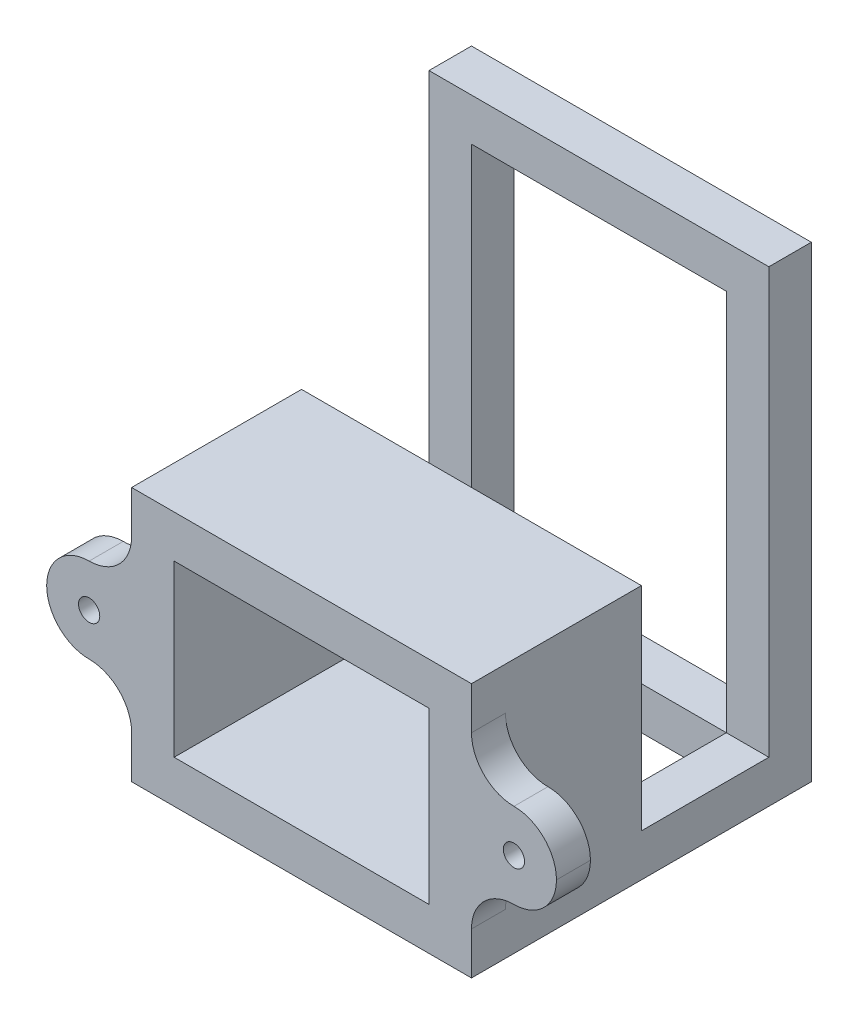
ISO-10303-21;
HEADER;
FILE_DESCRIPTION(('STEP AP214'),'2;1');
FILE_NAME('part.step','',(''),(''),'','','');
FILE_SCHEMA(('AUTOMOTIVE_DESIGN { 1 0 10303 214 1 1 1 1 }'));
ENDSEC;
DATA;
#1=APPLICATION_CONTEXT('core data for automotive mechanical design processes');
#2=APPLICATION_PROTOCOL_DEFINITION('international standard','automotive_design',2000,#1);
#3=PRODUCT_CONTEXT('',#1,'mechanical');
#4=PRODUCT('Part','Part','',(#3));
#5=PRODUCT_RELATED_PRODUCT_CATEGORY('part','',(#4));
#6=PRODUCT_DEFINITION_FORMATION('','',#4);
#7=PRODUCT_DEFINITION_CONTEXT('part definition',#1,'design');
#8=PRODUCT_DEFINITION('design','',#6,#7);
#9=PRODUCT_DEFINITION_SHAPE('','',#8);
#10=(LENGTH_UNIT() NAMED_UNIT(*) SI_UNIT(.MILLI.,.METRE.));
#11=(NAMED_UNIT(*) PLANE_ANGLE_UNIT() SI_UNIT($,.RADIAN.));
#12=(NAMED_UNIT(*) SI_UNIT($,.STERADIAN.) SOLID_ANGLE_UNIT());
#13=UNCERTAINTY_MEASURE_WITH_UNIT(LENGTH_MEASURE(1.E-05),#10,'distance_accuracy_value','');
#14=(GEOMETRIC_REPRESENTATION_CONTEXT(3) GLOBAL_UNCERTAINTY_ASSIGNED_CONTEXT((#13)) GLOBAL_UNIT_ASSIGNED_CONTEXT((#10,
#11,#12)) REPRESENTATION_CONTEXT('',''));
#15=CARTESIAN_POINT('',(0.,0.,0.));
#16=DIRECTION('',(0.,0.,1.));
#17=DIRECTION('',(1.,0.,0.));
#18=AXIS2_PLACEMENT_3D('',#15,#16,#17);
#19=CARTESIAN_POINT('',(-15.,-10.,20.));
#20=DIRECTION('',(0.,1.,0.));
#21=DIRECTION('',(0.,0.,1.));
#22=AXIS2_PLACEMENT_3D('',#19,#20,#21);
#23=PLANE('',#22);
#24=DIRECTION('',(0.,0.,1.));
#25=VECTOR('',#24,1.);
#26=CARTESIAN_POINT('',(20.,-10.,0.));
#27=LINE('',#26,#25);
#28=CARTESIAN_POINT('',(20.,-9.99999999999997,-15.));
#29=VERTEX_POINT('',#28);
#30=CARTESIAN_POINT('',(20.,-10.,0.));
#31=VERTEX_POINT('',#30);
#32=EDGE_CURVE('E331',#29,#31,#27,.T.);
#33=ORIENTED_EDGE('',*,*,#32,.F.);
#34=DIRECTION('',(-1.,0.,0.));
#35=VECTOR('',#34,1.);
#36=CARTESIAN_POINT('',(0.,-10.,-15.));
#37=LINE('',#36,#35);
#38=CARTESIAN_POINT('',(15.,-10.,-15.));
#39=VERTEX_POINT('',#38);
#40=EDGE_CURVE('E609',#29,#39,#37,.T.);
#41=ORIENTED_EDGE('',*,*,#40,.T.);
#42=DIRECTION('',(0.,0.,1.));
#43=VECTOR('',#42,1.);
#44=CARTESIAN_POINT('',(15.,-10.,-4.15209927586882));
#45=LINE('',#44,#43);
#46=CARTESIAN_POINT('',(15.,-9.99999999999999,-4.15209927586882));
#47=VERTEX_POINT('',#46);
#48=EDGE_CURVE('E332',#39,#47,#45,.T.);
#49=ORIENTED_EDGE('',*,*,#48,.T.);
#50=DIRECTION('',(-1.,0.,0.));
#51=VECTOR('',#50,1.);
#52=CARTESIAN_POINT('',(-15.,-10.,-4.15209927586882));
#53=LINE('',#52,#51);
#54=CARTESIAN_POINT('',(-15.,-10.,-4.15209927586882));
#55=VERTEX_POINT('',#54);
#56=EDGE_CURVE('E336',#47,#55,#53,.T.);
#57=ORIENTED_EDGE('',*,*,#56,.T.);
#58=DIRECTION('',(0.,0.,-1.));
#59=VECTOR('',#58,1.);
#60=CARTESIAN_POINT('',(-15.,-10.,-4.15209927586882));
#61=LINE('',#60,#59);
#62=CARTESIAN_POINT('',(-15.,-10.,-15.));
#63=VERTEX_POINT('',#62);
#64=EDGE_CURVE('E340',#55,#63,#61,.T.);
#65=ORIENTED_EDGE('',*,*,#64,.T.);
#66=DIRECTION('',(-1.,0.,0.));
#67=VECTOR('',#66,1.);
#68=CARTESIAN_POINT('',(0.,-10.,-15.));
#69=LINE('',#68,#67);
#70=CARTESIAN_POINT('',(-20.,-10.,-15.));
#71=VERTEX_POINT('',#70);
#72=EDGE_CURVE('E279',#63,#71,#69,.T.);
#73=ORIENTED_EDGE('',*,*,#72,.T.);
#74=DIRECTION('',(0.,0.,-1.));
#75=VECTOR('',#74,1.);
#76=CARTESIAN_POINT('',(-20.,-10.,0.));
#77=LINE('',#76,#75);
#78=CARTESIAN_POINT('',(-20.,-10.,0.));
#79=VERTEX_POINT('',#78);
#80=EDGE_CURVE('E74',#79,#71,#77,.T.);
#81=ORIENTED_EDGE('',*,*,#80,.F.);
#82=DIRECTION('',(-1.,0.,0.));
#83=VECTOR('',#82,1.);
#84=CARTESIAN_POINT('',(-20.,-10.,0.));
#85=LINE('',#84,#83);
#86=CARTESIAN_POINT('',(-15.,-10.,0.));
#87=VERTEX_POINT('',#86);
#88=EDGE_CURVE('E11',#87,#79,#85,.T.);
#89=ORIENTED_EDGE('',*,*,#88,.F.);
#90=DIRECTION('',(0.,0.,-1.));
#91=VECTOR('',#90,1.);
#92=CARTESIAN_POINT('',(-15.,-10.,20.));
#93=LINE('',#92,#91);
#94=CARTESIAN_POINT('',(-15.,-10.,20.));
#95=VERTEX_POINT('',#94);
#96=EDGE_CURVE('E415',#95,#87,#93,.T.);
#97=ORIENTED_EDGE('',*,*,#96,.F.);
#98=DIRECTION('',(1.,0.,0.));
#99=VECTOR('',#98,1.);
#100=CARTESIAN_POINT('',(-15.,-10.,20.));
#101=LINE('',#100,#99);
#102=CARTESIAN_POINT('',(15.,-10.,20.));
#103=VERTEX_POINT('',#102);
#104=EDGE_CURVE('E398',#95,#103,#101,.T.);
#105=ORIENTED_EDGE('',*,*,#104,.T.);
#106=DIRECTION('',(0.,0.,-1.));
#107=VECTOR('',#106,1.);
#108=CARTESIAN_POINT('',(15.,-10.,20.));
#109=LINE('',#108,#107);
#110=CARTESIAN_POINT('',(15.,-10.,0.));
#111=VERTEX_POINT('',#110);
#112=EDGE_CURVE('E401',#103,#111,#109,.T.);
#113=ORIENTED_EDGE('',*,*,#112,.T.);
#114=EDGE_CURVE('E59',#31,#111,#85,.T.);
#115=ORIENTED_EDGE('',*,*,#114,.F.);
#116=EDGE_LOOP('',(#33,#41,#49,#57,#65,#73,#81,#89,#97,#105,#113,#115));
#117=FACE_BOUND('',#116,.T.);
#118=ADVANCED_FACE('F47',(#117),#23,.T.);
#119=CARTESIAN_POINT('',(20.,15.,20.));
#120=DIRECTION('',(-1.,0.,0.));
#121=DIRECTION('',(0.,0.,1.));
#122=AXIS2_PLACEMENT_3D('',#119,#120,#121);
#123=PLANE('',#122);
#124=DIRECTION('',(0.,1.,0.));
#125=VECTOR('',#124,1.);
#126=CARTESIAN_POINT('',(20.,15.,20.));
#127=LINE('',#126,#125);
#128=CARTESIAN_POINT('',(20.,10.,20.));
#129=VERTEX_POINT('',#128);
#130=CARTESIAN_POINT('',(20.,15.,20.));
#131=VERTEX_POINT('',#130);
#132=EDGE_CURVE('E432',#129,#131,#127,.T.);
#133=ORIENTED_EDGE('',*,*,#132,.F.);
#134=DIRECTION('',(0.,0.,1.));
#135=VECTOR('',#134,1.);
#136=CARTESIAN_POINT('',(20.,10.,20.));
#137=LINE('',#136,#135);
#138=CARTESIAN_POINT('',(20.,10.,16.));
#139=VERTEX_POINT('',#138);
#140=EDGE_CURVE('E469',#129,#139,#137,.F.);
#141=ORIENTED_EDGE('',*,*,#140,.T.);
#142=DIRECTION('',(0.,-1.,0.));
#143=VECTOR('',#142,1.);
#144=CARTESIAN_POINT('',(20.,5.,16.));
#145=LINE('',#144,#143);
#146=CARTESIAN_POINT('',(20.,-10.,16.));
#147=VERTEX_POINT('',#146);
#148=EDGE_CURVE('E363',#139,#147,#145,.T.);
#149=ORIENTED_EDGE('',*,*,#148,.T.);
#150=DIRECTION('',(0.,0.,1.));
#151=VECTOR('',#150,1.);
#152=CARTESIAN_POINT('',(20.,-10.,20.));
#153=LINE('',#152,#151);
#154=CARTESIAN_POINT('',(20.,-10.,20.));
#155=VERTEX_POINT('',#154);
#156=EDGE_CURVE('E466',#147,#155,#153,.T.);
#157=ORIENTED_EDGE('',*,*,#156,.T.);
#158=CARTESIAN_POINT('',(20.,-15.,20.));
#159=VERTEX_POINT('',#158);
#160=EDGE_CURVE('E427',#159,#155,#127,.T.);
#161=ORIENTED_EDGE('',*,*,#160,.F.);
#162=DIRECTION('',(0.,0.,-1.));
#163=VECTOR('',#162,1.);
#164=CARTESIAN_POINT('',(20.,-15.,20.));
#165=LINE('',#164,#163);
#166=CARTESIAN_POINT('',(20.,-15.,-20.));
#167=VERTEX_POINT('',#166);
#168=EDGE_CURVE('E443',#159,#167,#165,.T.);
#169=ORIENTED_EDGE('',*,*,#168,.T.);
#170=DIRECTION('',(0.,-1.,0.));
#171=VECTOR('',#170,1.);
#172=CARTESIAN_POINT('',(20.,34.7213595499958,-20.));
#173=LINE('',#172,#171);
#174=CARTESIAN_POINT('',(20.,40.,-20.));
#175=VERTEX_POINT('',#174);
#176=EDGE_CURVE('E330',#175,#167,#173,.T.);
#177=ORIENTED_EDGE('',*,*,#176,.F.);
#178=DIRECTION('',(0.,0.,-1.));
#179=VECTOR('',#178,1.);
#180=CARTESIAN_POINT('',(20.,40.,49.0312423743285));
#181=LINE('',#180,#179);
#182=CARTESIAN_POINT('',(20.,40.,-15.));
#183=VERTEX_POINT('',#182);
#184=EDGE_CURVE('E266',#183,#175,#181,.T.);
#185=ORIENTED_EDGE('',*,*,#184,.F.);
#186=DIRECTION('',(0.,-1.,0.));
#187=VECTOR('',#186,1.);
#188=CARTESIAN_POINT('',(20.,0.,-15.));
#189=LINE('',#188,#187);
#190=EDGE_CURVE('E614',#183,#29,#189,.T.);
#191=ORIENTED_EDGE('',*,*,#190,.T.);
#192=ORIENTED_EDGE('',*,*,#32,.T.);
#193=DIRECTION('',(0.,1.,0.));
#194=VECTOR('',#193,1.);
#195=CARTESIAN_POINT('',(20.,15.,0.));
#196=LINE('',#195,#194);
#197=CARTESIAN_POINT('',(20.,15.,0.));
#198=VERTEX_POINT('',#197);
#199=EDGE_CURVE('E426',#31,#198,#196,.T.);
#200=ORIENTED_EDGE('',*,*,#199,.T.);
#201=DIRECTION('',(0.,0.,-1.));
#202=VECTOR('',#201,1.);
#203=CARTESIAN_POINT('',(20.,15.,20.));
#204=LINE('',#203,#202);
#205=EDGE_CURVE('E462',#131,#198,#204,.T.);
#206=ORIENTED_EDGE('',*,*,#205,.F.);
#207=EDGE_LOOP('',(#133,#141,#149,#157,#161,#169,#177,#185,#191,#192,#200,#206));
#208=FACE_BOUND('',#207,.T.);
#209=ADVANCED_FACE('F585',(#208),#123,.F.);
#210=CARTESIAN_POINT('',(-20.,15.,20.));
#211=DIRECTION('',(1.,0.,0.));
#212=DIRECTION('',(0.,0.,-1.));
#213=AXIS2_PLACEMENT_3D('',#210,#211,#212);
#214=PLANE('',#213);
#215=DIRECTION('',(0.,-1.,0.));
#216=VECTOR('',#215,1.);
#217=CARTESIAN_POINT('',(-20.,15.,20.));
#218=LINE('',#217,#216);
#219=CARTESIAN_POINT('',(-20.,-10.,20.));
#220=VERTEX_POINT('',#219);
#221=CARTESIAN_POINT('',(-20.,-15.,20.));
#222=VERTEX_POINT('',#221);
#223=EDGE_CURVE('E435',#220,#222,#218,.T.);
#224=ORIENTED_EDGE('',*,*,#223,.F.);
#225=DIRECTION('',(0.,0.,1.));
#226=VECTOR('',#225,1.);
#227=CARTESIAN_POINT('',(-20.,-10.,20.));
#228=LINE('',#227,#226);
#229=CARTESIAN_POINT('',(-20.,-10.,16.));
#230=VERTEX_POINT('',#229);
#231=EDGE_CURVE('E494',#220,#230,#228,.F.);
#232=ORIENTED_EDGE('',*,*,#231,.T.);
#233=DIRECTION('',(0.,1.,0.));
#234=VECTOR('',#233,1.);
#235=CARTESIAN_POINT('',(-20.,5.,16.));
#236=LINE('',#235,#234);
#237=CARTESIAN_POINT('',(-20.,10.,16.));
#238=VERTEX_POINT('',#237);
#239=EDGE_CURVE('E380',#230,#238,#236,.T.);
#240=ORIENTED_EDGE('',*,*,#239,.T.);
#241=DIRECTION('',(0.,0.,1.));
#242=VECTOR('',#241,1.);
#243=CARTESIAN_POINT('',(-20.,10.,20.));
#244=LINE('',#243,#242);
#245=CARTESIAN_POINT('',(-20.,10.,20.));
#246=VERTEX_POINT('',#245);
#247=EDGE_CURVE('E491',#238,#246,#244,.T.);
#248=ORIENTED_EDGE('',*,*,#247,.T.);
#249=CARTESIAN_POINT('',(-20.,15.,20.));
#250=VERTEX_POINT('',#249);
#251=EDGE_CURVE('E436',#250,#246,#218,.T.);
#252=ORIENTED_EDGE('',*,*,#251,.F.);
#253=DIRECTION('',(0.,0.,-1.));
#254=VECTOR('',#253,1.);
#255=CARTESIAN_POINT('',(-20.,15.,20.));
#256=LINE('',#255,#254);
#257=CARTESIAN_POINT('',(-20.,15.,0.));
#258=VERTEX_POINT('',#257);
#259=EDGE_CURVE('E458',#250,#258,#256,.T.);
#260=ORIENTED_EDGE('',*,*,#259,.T.);
#261=DIRECTION('',(0.,-1.,0.));
#262=VECTOR('',#261,1.);
#263=CARTESIAN_POINT('',(-20.,15.,0.));
#264=LINE('',#263,#262);
#265=EDGE_CURVE('E449',#258,#79,#264,.T.);
#266=ORIENTED_EDGE('',*,*,#265,.T.);
#267=ORIENTED_EDGE('',*,*,#80,.T.);
#268=DIRECTION('',(0.,-1.,0.));
#269=VECTOR('',#268,1.);
#270=CARTESIAN_POINT('',(-20.,0.,-15.));
#271=LINE('',#270,#269);
#272=CARTESIAN_POINT('',(-20.,40.,-15.));
#273=VERTEX_POINT('',#272);
#274=EDGE_CURVE('E262',#273,#71,#271,.T.);
#275=ORIENTED_EDGE('',*,*,#274,.F.);
#276=DIRECTION('',(0.,0.,-1.));
#277=VECTOR('',#276,1.);
#278=CARTESIAN_POINT('',(-20.,40.,49.0312423743285));
#279=LINE('',#278,#277);
#280=CARTESIAN_POINT('',(-20.,40.,-20.));
#281=VERTEX_POINT('',#280);
#282=EDGE_CURVE('E259',#273,#281,#279,.T.);
#283=ORIENTED_EDGE('',*,*,#282,.T.);
#284=DIRECTION('',(0.,-1.,0.));
#285=VECTOR('',#284,1.);
#286=CARTESIAN_POINT('',(-20.,34.7213595499958,-20.));
#287=LINE('',#286,#285);
#288=CARTESIAN_POINT('',(-20.,-15.,-20.));
#289=VERTEX_POINT('',#288);
#290=EDGE_CURVE('E245',#281,#289,#287,.T.);
#291=ORIENTED_EDGE('',*,*,#290,.T.);
#292=DIRECTION('',(0.,0.,-1.));
#293=VECTOR('',#292,1.);
#294=CARTESIAN_POINT('',(-20.,-15.,20.));
#295=LINE('',#294,#293);
#296=EDGE_CURVE('E455',#222,#289,#295,.T.);
#297=ORIENTED_EDGE('',*,*,#296,.F.);
#298=EDGE_LOOP('',(#224,#232,#240,#248,#252,#260,#266,#267,#275,#283,#291,#297));
#299=FACE_BOUND('',#298,.T.);
#300=ADVANCED_FACE('F261',(#299),#214,.F.);
#301=CARTESIAN_POINT('',(0.,0.,20.));
#302=DIRECTION('',(0.,0.,1.));
#303=DIRECTION('',(1.,0.,0.));
#304=AXIS2_PLACEMENT_3D('',#301,#302,#303);
#305=PLANE('',#304);
#306=CARTESIAN_POINT('',(25.,0.,20.));
#307=DIRECTION('',(0.,0.,1.));
#308=DIRECTION('',(1.,0.,0.));
#309=AXIS2_PLACEMENT_3D('',#306,#307,#308);
#310=CIRCLE('',#309,5.);
#311=CARTESIAN_POINT('',(25.,-5.,20.));
#312=VERTEX_POINT('',#311);
#313=CARTESIAN_POINT('',(30.,0.,20.));
#314=VERTEX_POINT('',#313);
#315=EDGE_CURVE('E479',#312,#314,#310,.T.);
#316=ORIENTED_EDGE('',*,*,#315,.T.);
#317=CARTESIAN_POINT('',(25.,0.,20.));
#318=DIRECTION('',(0.,0.,1.));
#319=DIRECTION('',(1.,0.,0.));
#320=AXIS2_PLACEMENT_3D('',#317,#318,#319);
#321=CIRCLE('',#320,5.);
#322=CARTESIAN_POINT('',(25.,5.,20.));
#323=VERTEX_POINT('',#322);
#324=EDGE_CURVE('E482',#314,#323,#321,.T.);
#325=ORIENTED_EDGE('',*,*,#324,.T.);
#326=CARTESIAN_POINT('',(25.,10.,20.));
#327=DIRECTION('',(0.,0.,1.));
#328=DIRECTION('',(1.,0.,0.));
#329=AXIS2_PLACEMENT_3D('',#326,#327,#328);
#330=CIRCLE('',#329,5.);
#331=EDGE_CURVE('E504',#323,#129,#330,.F.);
#332=ORIENTED_EDGE('',*,*,#331,.T.);
#333=ORIENTED_EDGE('',*,*,#132,.T.);
#334=DIRECTION('',(-1.,0.,0.));
#335=VECTOR('',#334,1.);
#336=CARTESIAN_POINT('',(-20.,15.,20.));
#337=LINE('',#336,#335);
#338=EDGE_CURVE('E431',#131,#250,#337,.T.);
#339=ORIENTED_EDGE('',*,*,#338,.T.);
#340=ORIENTED_EDGE('',*,*,#251,.T.);
#341=CARTESIAN_POINT('',(-25.,10.,20.));
#342=DIRECTION('',(0.,0.,1.));
#343=DIRECTION('',(1.,0.,0.));
#344=AXIS2_PLACEMENT_3D('',#341,#342,#343);
#345=CIRCLE('',#344,5.);
#346=CARTESIAN_POINT('',(-25.,5.,20.));
#347=VERTEX_POINT('',#346);
#348=EDGE_CURVE('E523',#246,#347,#345,.F.);
#349=ORIENTED_EDGE('',*,*,#348,.T.);
#350=CARTESIAN_POINT('',(-25.,0.,20.));
#351=DIRECTION('',(0.,0.,1.));
#352=DIRECTION('',(1.,0.,0.));
#353=AXIS2_PLACEMENT_3D('',#350,#351,#352);
#354=CIRCLE('',#353,5.);
#355=CARTESIAN_POINT('',(-30.,0.,20.));
#356=VERTEX_POINT('',#355);
#357=EDGE_CURVE('E473',#347,#356,#354,.T.);
#358=ORIENTED_EDGE('',*,*,#357,.T.);
#359=CARTESIAN_POINT('',(-25.,0.,20.));
#360=DIRECTION('',(0.,0.,1.));
#361=DIRECTION('',(1.,0.,0.));
#362=AXIS2_PLACEMENT_3D('',#359,#360,#361);
#363=CIRCLE('',#362,5.);
#364=CARTESIAN_POINT('',(-25.,-5.,20.));
#365=VERTEX_POINT('',#364);
#366=EDGE_CURVE('E476',#356,#365,#363,.T.);
#367=ORIENTED_EDGE('',*,*,#366,.T.);
#368=CARTESIAN_POINT('',(-25.,-10.,20.));
#369=DIRECTION('',(0.,0.,1.));
#370=DIRECTION('',(1.,0.,0.));
#371=AXIS2_PLACEMENT_3D('',#368,#369,#370);
#372=CIRCLE('',#371,5.);
#373=EDGE_CURVE('E517',#365,#220,#372,.F.);
#374=ORIENTED_EDGE('',*,*,#373,.T.);
#375=ORIENTED_EDGE('',*,*,#223,.T.);
#376=DIRECTION('',(1.,0.,0.));
#377=VECTOR('',#376,1.);
#378=CARTESIAN_POINT('',(-20.,-15.,20.));
#379=LINE('',#378,#377);
#380=EDGE_CURVE('E440',#222,#159,#379,.T.);
#381=ORIENTED_EDGE('',*,*,#380,.T.);
#382=ORIENTED_EDGE('',*,*,#160,.T.);
#383=CARTESIAN_POINT('',(25.,-10.,20.));
#384=DIRECTION('',(0.,0.,1.));
#385=DIRECTION('',(1.,0.,0.));
#386=AXIS2_PLACEMENT_3D('',#383,#384,#385);
#387=CIRCLE('',#386,5.);
#388=EDGE_CURVE('E510',#155,#312,#387,.F.);
#389=ORIENTED_EDGE('',*,*,#388,.T.);
#390=EDGE_LOOP('',(#316,#325,#332,#333,#339,#340,#349,#358,#367,#374,#375,#381,#382,#389));
#391=FACE_BOUND('',#390,.T.);
#392=DIRECTION('',(-1.,0.,0.));
#393=VECTOR('',#392,1.);
#394=CARTESIAN_POINT('',(-15.,10.,20.));
#395=LINE('',#394,#393);
#396=CARTESIAN_POINT('',(15.,10.,20.));
#397=VERTEX_POINT('',#396);
#398=CARTESIAN_POINT('',(-15.,10.,20.));
#399=VERTEX_POINT('',#398);
#400=EDGE_CURVE('E390',#397,#399,#395,.T.);
#401=ORIENTED_EDGE('',*,*,#400,.F.);
#402=DIRECTION('',(0.,1.,0.));
#403=VECTOR('',#402,1.);
#404=CARTESIAN_POINT('',(15.,10.,20.));
#405=LINE('',#404,#403);
#406=EDGE_CURVE('E387',#103,#397,#405,.T.);
#407=ORIENTED_EDGE('',*,*,#406,.F.);
#408=ORIENTED_EDGE('',*,*,#104,.F.);
#409=DIRECTION('',(0.,-1.,0.));
#410=VECTOR('',#409,1.);
#411=CARTESIAN_POINT('',(-15.,10.,20.));
#412=LINE('',#411,#410);
#413=EDGE_CURVE('E394',#399,#95,#412,.T.);
#414=ORIENTED_EDGE('',*,*,#413,.F.);
#415=EDGE_LOOP('',(#401,#407,#408,#414));
#416=FACE_BOUND('',#415,.T.);
#417=CARTESIAN_POINT('',(-25.,0.,20.));
#418=DIRECTION('',(0.,0.,1.));
#419=DIRECTION('',(1.,0.,0.));
#420=AXIS2_PLACEMENT_3D('',#417,#418,#419);
#421=CIRCLE('',#420,1.25);
#422=CARTESIAN_POINT('',(-23.75,0.,20.));
#423=VERTEX_POINT('',#422);
#424=EDGE_CURVE('E372',#423,#423,#421,.T.);
#425=ORIENTED_EDGE('',*,*,#424,.F.);
#426=EDGE_LOOP('',(#425));
#427=FACE_BOUND('',#426,.T.);
#428=CARTESIAN_POINT('',(25.,0.,20.));
#429=DIRECTION('',(0.,0.,1.));
#430=DIRECTION('',(-1.,0.,0.));
#431=AXIS2_PLACEMENT_3D('',#428,#429,#430);
#432=CIRCLE('',#431,1.25);
#433=CARTESIAN_POINT('',(23.75,0.,20.));
#434=VERTEX_POINT('',#433);
#435=EDGE_CURVE('E368',#434,#434,#432,.T.);
#436=ORIENTED_EDGE('',*,*,#435,.F.);
#437=EDGE_LOOP('',(#436));
#438=FACE_BOUND('',#437,.T.);
#439=ADVANCED_FACE('F570',(#391,#416,#427,#438),#305,.T.);
#440=CARTESIAN_POINT('',(0.,0.,0.));
#441=DIRECTION('',(0.,0.,1.));
#442=DIRECTION('',(1.,0.,0.));
#443=AXIS2_PLACEMENT_3D('',#440,#441,#442);
#444=PLANE('',#443);
#445=ORIENTED_EDGE('',*,*,#199,.F.);
#446=ORIENTED_EDGE('',*,*,#114,.T.);
#447=DIRECTION('',(0.,1.,0.));
#448=VECTOR('',#447,1.);
#449=CARTESIAN_POINT('',(15.,10.,0.));
#450=LINE('',#449,#448);
#451=CARTESIAN_POINT('',(15.,10.,0.));
#452=VERTEX_POINT('',#451);
#453=EDGE_CURVE('E386',#111,#452,#450,.T.);
#454=ORIENTED_EDGE('',*,*,#453,.T.);
#455=DIRECTION('',(-1.,0.,0.));
#456=VECTOR('',#455,1.);
#457=CARTESIAN_POINT('',(-15.,10.,0.));
#458=LINE('',#457,#456);
#459=CARTESIAN_POINT('',(-15.,10.,0.));
#460=VERTEX_POINT('',#459);
#461=EDGE_CURVE('E405',#452,#460,#458,.T.);
#462=ORIENTED_EDGE('',*,*,#461,.T.);
#463=DIRECTION('',(0.,-1.,0.));
#464=VECTOR('',#463,1.);
#465=CARTESIAN_POINT('',(-15.,10.,0.));
#466=LINE('',#465,#464);
#467=EDGE_CURVE('E391',#460,#87,#466,.T.);
#468=ORIENTED_EDGE('',*,*,#467,.T.);
#469=ORIENTED_EDGE('',*,*,#88,.T.);
#470=ORIENTED_EDGE('',*,*,#265,.F.);
#471=DIRECTION('',(-1.,0.,0.));
#472=VECTOR('',#471,1.);
#473=CARTESIAN_POINT('',(-20.,15.,0.));
#474=LINE('',#473,#472);
#475=EDGE_CURVE('E446',#198,#258,#474,.T.);
#476=ORIENTED_EDGE('',*,*,#475,.F.);
#477=EDGE_LOOP('',(#445,#446,#454,#462,#468,#469,#470,#476));
#478=FACE_BOUND('',#477,.T.);
#479=ADVANCED_FACE('F593',(#478),#444,.F.);
#480=CARTESIAN_POINT('',(-20.,15.,20.));
#481=DIRECTION('',(0.,-1.,0.));
#482=DIRECTION('',(0.,0.,-1.));
#483=AXIS2_PLACEMENT_3D('',#480,#481,#482);
#484=PLANE('',#483);
#485=ORIENTED_EDGE('',*,*,#475,.T.);
#486=ORIENTED_EDGE('',*,*,#259,.F.);
#487=ORIENTED_EDGE('',*,*,#338,.F.);
#488=ORIENTED_EDGE('',*,*,#205,.T.);
#489=EDGE_LOOP('',(#485,#486,#487,#488));
#490=FACE_BOUND('',#489,.T.);
#491=ADVANCED_FACE('F583',(#490),#484,.F.);
#492=CARTESIAN_POINT('',(-20.,-15.,20.));
#493=DIRECTION('',(0.,1.,0.));
#494=DIRECTION('',(0.,0.,1.));
#495=AXIS2_PLACEMENT_3D('',#492,#493,#494);
#496=PLANE('',#495);
#497=ORIENTED_EDGE('',*,*,#296,.T.);
#498=DIRECTION('',(1.,0.,0.));
#499=VECTOR('',#498,1.);
#500=CARTESIAN_POINT('',(-20.,-15.,-20.));
#501=LINE('',#500,#499);
#502=EDGE_CURVE('E252',#289,#167,#501,.T.);
#503=ORIENTED_EDGE('',*,*,#502,.T.);
#504=ORIENTED_EDGE('',*,*,#168,.F.);
#505=ORIENTED_EDGE('',*,*,#380,.F.);
#506=EDGE_LOOP('',(#497,#503,#504,#505));
#507=FACE_BOUND('',#506,.T.);
#508=DIRECTION('',(0.,0.,1.));
#509=VECTOR('',#508,1.);
#510=CARTESIAN_POINT('',(15.,-15.,-4.15209927586882));
#511=LINE('',#510,#509);
#512=CARTESIAN_POINT('',(15.,-15.,-15.));
#513=VERTEX_POINT('',#512);
#514=CARTESIAN_POINT('',(15.,-15.,-4.15209927586882));
#515=VERTEX_POINT('',#514);
#516=EDGE_CURVE('E322',#513,#515,#511,.T.);
#517=ORIENTED_EDGE('',*,*,#516,.F.);
#518=DIRECTION('',(1.,0.,0.));
#519=VECTOR('',#518,1.);
#520=CARTESIAN_POINT('',(-15.,-15.,-15.));
#521=LINE('',#520,#519);
#522=CARTESIAN_POINT('',(-15.,-15.,-15.));
#523=VERTEX_POINT('',#522);
#524=EDGE_CURVE('E308',#523,#513,#521,.T.);
#525=ORIENTED_EDGE('',*,*,#524,.F.);
#526=DIRECTION('',(0.,0.,-1.));
#527=VECTOR('',#526,1.);
#528=CARTESIAN_POINT('',(-15.,-15.,-4.15209927586882));
#529=LINE('',#528,#527);
#530=CARTESIAN_POINT('',(-15.,-15.,-4.15209927586882));
#531=VERTEX_POINT('',#530);
#532=EDGE_CURVE('E314',#531,#523,#529,.T.);
#533=ORIENTED_EDGE('',*,*,#532,.F.);
#534=DIRECTION('',(-1.,0.,0.));
#535=VECTOR('',#534,1.);
#536=CARTESIAN_POINT('',(-15.,-15.,-4.15209927586882));
#537=LINE('',#536,#535);
#538=EDGE_CURVE('E307',#515,#531,#537,.T.);
#539=ORIENTED_EDGE('',*,*,#538,.F.);
#540=EDGE_LOOP('',(#517,#525,#533,#539));
#541=FACE_BOUND('',#540,.T.);
#542=ADVANCED_FACE('F652',(#507,#541),#496,.F.);
#543=CARTESIAN_POINT('',(15.,10.,20.));
#544=DIRECTION('',(-1.,0.,0.));
#545=DIRECTION('',(0.,-1.,0.));
#546=AXIS2_PLACEMENT_3D('',#543,#544,#545);
#547=PLANE('',#546);
#548=ORIENTED_EDGE('',*,*,#453,.F.);
#549=ORIENTED_EDGE('',*,*,#112,.F.);
#550=ORIENTED_EDGE('',*,*,#406,.T.);
#551=DIRECTION('',(0.,0.,-1.));
#552=VECTOR('',#551,1.);
#553=CARTESIAN_POINT('',(15.,10.,20.));
#554=LINE('',#553,#552);
#555=EDGE_CURVE('E422',#397,#452,#554,.T.);
#556=ORIENTED_EDGE('',*,*,#555,.T.);
#557=EDGE_LOOP('',(#548,#549,#550,#556));
#558=FACE_BOUND('',#557,.T.);
#559=ADVANCED_FACE('F606',(#558),#547,.T.);
#560=CARTESIAN_POINT('',(-15.,10.,20.));
#561=DIRECTION('',(0.,-1.,0.));
#562=DIRECTION('',(0.,0.,-1.));
#563=AXIS2_PLACEMENT_3D('',#560,#561,#562);
#564=PLANE('',#563);
#565=ORIENTED_EDGE('',*,*,#461,.F.);
#566=ORIENTED_EDGE('',*,*,#555,.F.);
#567=ORIENTED_EDGE('',*,*,#400,.T.);
#568=DIRECTION('',(0.,0.,-1.));
#569=VECTOR('',#568,1.);
#570=CARTESIAN_POINT('',(-15.,10.,20.));
#571=LINE('',#570,#569);
#572=EDGE_CURVE('E419',#399,#460,#571,.T.);
#573=ORIENTED_EDGE('',*,*,#572,.T.);
#574=EDGE_LOOP('',(#565,#566,#567,#573));
#575=FACE_BOUND('',#574,.T.);
#576=ADVANCED_FACE('F707',(#575),#564,.T.);
#577=CARTESIAN_POINT('',(-15.,10.,20.));
#578=DIRECTION('',(1.,0.,0.));
#579=DIRECTION('',(0.,1.,0.));
#580=AXIS2_PLACEMENT_3D('',#577,#578,#579);
#581=PLANE('',#580);
#582=ORIENTED_EDGE('',*,*,#467,.F.);
#583=ORIENTED_EDGE('',*,*,#572,.F.);
#584=ORIENTED_EDGE('',*,*,#413,.T.);
#585=ORIENTED_EDGE('',*,*,#96,.T.);
#586=EDGE_LOOP('',(#582,#583,#584,#585));
#587=FACE_BOUND('',#586,.T.);
#588=ADVANCED_FACE('F596',(#587),#581,.T.);
#589=DIRECTION('',(0.,0.,-1.));
#590=VECTOR('',#589,1.);
#591=CARTESIAN_POINT('',(15.,-10.,49.0312423743285));
#592=LINE('',#591,#590);
#593=CARTESIAN_POINT('',(15.,-10.,-20.));
#594=VERTEX_POINT('',#593);
#595=EDGE_CURVE('E296',#39,#594,#592,.T.);
#596=ORIENTED_EDGE('',*,*,#595,.T.);
#597=DIRECTION('',(1.,0.,0.));
#598=VECTOR('',#597,1.);
#599=CARTESIAN_POINT('',(-20.,-10.,-20.));
#600=LINE('',#599,#598);
#601=CARTESIAN_POINT('',(-15.,-10.,-20.));
#602=VERTEX_POINT('',#601);
#603=EDGE_CURVE('E327',#602,#594,#600,.T.);
#604=ORIENTED_EDGE('',*,*,#603,.F.);
#605=DIRECTION('',(0.,0.,-1.));
#606=VECTOR('',#605,1.);
#607=CARTESIAN_POINT('',(-15.,-10.,49.0312423743285));
#608=LINE('',#607,#606);
#609=EDGE_CURVE('E286',#63,#602,#608,.T.);
#610=ORIENTED_EDGE('',*,*,#609,.F.);
#611=DIRECTION('',(1.,0.,0.));
#612=VECTOR('',#611,1.);
#613=CARTESIAN_POINT('',(-15.,-10.,-15.));
#614=LINE('',#613,#612);
#615=EDGE_CURVE('E306',#63,#39,#614,.T.);
#616=ORIENTED_EDGE('',*,*,#615,.T.);
#617=EDGE_LOOP('',(#596,#604,#610,#616));
#618=FACE_BOUND('',#617,.T.);
#619=ADVANCED_FACE('F628',(#618),#23,.T.);
#620=CARTESIAN_POINT('',(0.,0.,16.));
#621=DIRECTION('',(0.,0.,-1.));
#622=DIRECTION('',(-1.,0.,0.));
#623=AXIS2_PLACEMENT_3D('',#620,#621,#622);
#624=PLANE('',#623);
#625=CARTESIAN_POINT('',(-25.,0.,16.));
#626=DIRECTION('',(0.,0.,1.));
#627=DIRECTION('',(1.,0.,0.));
#628=AXIS2_PLACEMENT_3D('',#625,#626,#627);
#629=CIRCLE('',#628,1.25);
#630=CARTESIAN_POINT('',(-23.75,0.,16.));
#631=VERTEX_POINT('',#630);
#632=EDGE_CURVE('E376',#631,#631,#629,.T.);
#633=ORIENTED_EDGE('',*,*,#632,.T.);
#634=EDGE_LOOP('',(#633));
#635=FACE_BOUND('',#634,.T.);
#636=ORIENTED_EDGE('',*,*,#239,.F.);
#637=CARTESIAN_POINT('',(-25.,-10.,16.));
#638=DIRECTION('',(0.,0.,-1.));
#639=DIRECTION('',(-1.,0.,0.));
#640=AXIS2_PLACEMENT_3D('',#637,#638,#639);
#641=CIRCLE('',#640,5.);
#642=CARTESIAN_POINT('',(-25.,-5.,16.));
#643=VERTEX_POINT('',#642);
#644=EDGE_CURVE('E520',#230,#643,#641,.F.);
#645=ORIENTED_EDGE('',*,*,#644,.T.);
#646=CARTESIAN_POINT('',(-25.,0.,16.));
#647=DIRECTION('',(0.,0.,-1.));
#648=DIRECTION('',(-1.,0.,0.));
#649=AXIS2_PLACEMENT_3D('',#646,#647,#648);
#650=CIRCLE('',#649,5.);
#651=CARTESIAN_POINT('',(-30.,0.,16.));
#652=VERTEX_POINT('',#651);
#653=EDGE_CURVE('E501',#643,#652,#650,.T.);
#654=ORIENTED_EDGE('',*,*,#653,.T.);
#655=CARTESIAN_POINT('',(-25.,0.,16.));
#656=DIRECTION('',(0.,0.,-1.));
#657=DIRECTION('',(-1.,0.,0.));
#658=AXIS2_PLACEMENT_3D('',#655,#656,#657);
#659=CIRCLE('',#658,5.);
#660=CARTESIAN_POINT('',(-25.,5.,16.));
#661=VERTEX_POINT('',#660);
#662=EDGE_CURVE('E498',#652,#661,#659,.T.);
#663=ORIENTED_EDGE('',*,*,#662,.T.);
#664=CARTESIAN_POINT('',(-25.,10.,16.));
#665=DIRECTION('',(0.,0.,-1.));
#666=DIRECTION('',(-1.,0.,0.));
#667=AXIS2_PLACEMENT_3D('',#664,#665,#666);
#668=CIRCLE('',#667,5.);
#669=EDGE_CURVE('E57',#661,#238,#668,.F.);
#670=ORIENTED_EDGE('',*,*,#669,.T.);
#671=EDGE_LOOP('',(#636,#645,#654,#663,#670));
#672=FACE_BOUND('',#671,.T.);
#673=ADVANCED_FACE('F561',(#635,#672),#624,.T.);
#674=CARTESIAN_POINT('',(-25.,0.,16.));
#675=DIRECTION('',(0.,0.,1.));
#676=DIRECTION('',(1.,0.,0.));
#677=AXIS2_PLACEMENT_3D('',#674,#675,#676);
#678=CYLINDRICAL_SURFACE('',#677,1.25);
#679=ORIENTED_EDGE('',*,*,#632,.F.);
#680=EDGE_LOOP('',(#679));
#681=FACE_BOUND('',#680,.T.);
#682=ORIENTED_EDGE('',*,*,#424,.T.);
#683=EDGE_LOOP('',(#682));
#684=FACE_BOUND('',#683,.T.);
#685=ADVANCED_FACE('F677',(#681,#684),#678,.F.);
#686=CARTESIAN_POINT('',(0.,0.,16.));
#687=DIRECTION('',(0.,0.,-1.));
#688=DIRECTION('',(-1.,0.,0.));
#689=AXIS2_PLACEMENT_3D('',#686,#687,#688);
#690=PLANE('',#689);
#691=CARTESIAN_POINT('',(25.,0.,16.));
#692=DIRECTION('',(0.,0.,1.));
#693=DIRECTION('',(-1.,0.,0.));
#694=AXIS2_PLACEMENT_3D('',#691,#692,#693);
#695=CIRCLE('',#694,1.25);
#696=CARTESIAN_POINT('',(23.75,0.,16.));
#697=VERTEX_POINT('',#696);
#698=EDGE_CURVE('E366',#697,#697,#695,.T.);
#699=ORIENTED_EDGE('',*,*,#698,.T.);
#700=EDGE_LOOP('',(#699));
#701=FACE_BOUND('',#700,.T.);
#702=ORIENTED_EDGE('',*,*,#148,.F.);
#703=CARTESIAN_POINT('',(25.,10.,16.));
#704=DIRECTION('',(0.,0.,-1.));
#705=DIRECTION('',(-1.,0.,0.));
#706=AXIS2_PLACEMENT_3D('',#703,#704,#705);
#707=CIRCLE('',#706,5.);
#708=CARTESIAN_POINT('',(25.,5.,16.));
#709=VERTEX_POINT('',#708);
#710=EDGE_CURVE('E507',#139,#709,#707,.F.);
#711=ORIENTED_EDGE('',*,*,#710,.T.);
#712=CARTESIAN_POINT('',(25.,0.,16.));
#713=DIRECTION('',(0.,0.,-1.));
#714=DIRECTION('',(-1.,0.,0.));
#715=AXIS2_PLACEMENT_3D('',#712,#713,#714);
#716=CIRCLE('',#715,5.);
#717=CARTESIAN_POINT('',(30.,0.,16.));
#718=VERTEX_POINT('',#717);
#719=EDGE_CURVE('E488',#709,#718,#716,.T.);
#720=ORIENTED_EDGE('',*,*,#719,.T.);
#721=CARTESIAN_POINT('',(25.,0.,16.));
#722=DIRECTION('',(0.,0.,-1.));
#723=DIRECTION('',(-1.,0.,0.));
#724=AXIS2_PLACEMENT_3D('',#721,#722,#723);
#725=CIRCLE('',#724,5.);
#726=CARTESIAN_POINT('',(25.,-5.,16.));
#727=VERTEX_POINT('',#726);
#728=EDGE_CURVE('E485',#718,#727,#725,.T.);
#729=ORIENTED_EDGE('',*,*,#728,.T.);
#730=CARTESIAN_POINT('',(25.,-10.,16.));
#731=DIRECTION('',(0.,0.,-1.));
#732=DIRECTION('',(-1.,0.,0.));
#733=AXIS2_PLACEMENT_3D('',#730,#731,#732);
#734=CIRCLE('',#733,5.);
#735=EDGE_CURVE('E513',#727,#147,#734,.F.);
#736=ORIENTED_EDGE('',*,*,#735,.T.);
#737=EDGE_LOOP('',(#702,#711,#720,#729,#736));
#738=FACE_BOUND('',#737,.T.);
#739=ADVANCED_FACE('F674',(#701,#738),#690,.T.);
#740=CARTESIAN_POINT('',(25.,0.,16.));
#741=DIRECTION('',(0.,0.,1.));
#742=DIRECTION('',(1.,0.,0.));
#743=AXIS2_PLACEMENT_3D('',#740,#741,#742);
#744=CYLINDRICAL_SURFACE('',#743,1.25);
#745=ORIENTED_EDGE('',*,*,#698,.F.);
#746=EDGE_LOOP('',(#745));
#747=FACE_BOUND('',#746,.T.);
#748=ORIENTED_EDGE('',*,*,#435,.T.);
#749=EDGE_LOOP('',(#748));
#750=FACE_BOUND('',#749,.T.);
#751=ADVANCED_FACE('F676',(#747,#750),#744,.F.);
#752=CARTESIAN_POINT('',(25.,-10.,20.));
#753=DIRECTION('',(0.,0.,1.));
#754=DIRECTION('',(1.,0.,0.));
#755=AXIS2_PLACEMENT_3D('',#752,#753,#754);
#756=CYLINDRICAL_SURFACE('',#755,5.);
#757=ORIENTED_EDGE('',*,*,#156,.F.);
#758=ORIENTED_EDGE('',*,*,#735,.F.);
#759=DIRECTION('',(0.,0.,1.));
#760=VECTOR('',#759,1.);
#761=CARTESIAN_POINT('',(25.,-5.,16.));
#762=LINE('',#761,#760);
#763=EDGE_CURVE('E367',#312,#727,#762,.F.);
#764=ORIENTED_EDGE('',*,*,#763,.F.);
#765=ORIENTED_EDGE('',*,*,#388,.F.);
#766=EDGE_LOOP('',(#757,#758,#764,#765));
#767=FACE_BOUND('',#766,.T.);
#768=ADVANCED_FACE('F658',(#767),#756,.F.);
#769=CARTESIAN_POINT('',(25.,0.,16.));
#770=DIRECTION('',(0.,0.,1.));
#771=DIRECTION('',(1.,0.,0.));
#772=AXIS2_PLACEMENT_3D('',#769,#770,#771);
#773=CYLINDRICAL_SURFACE('',#772,5.);
#774=ORIENTED_EDGE('',*,*,#763,.T.);
#775=ORIENTED_EDGE('',*,*,#728,.F.);
#776=DIRECTION('',(0.,0.,1.));
#777=VECTOR('',#776,1.);
#778=CARTESIAN_POINT('',(30.,0.,16.));
#779=LINE('',#778,#777);
#780=EDGE_CURVE('E533',#314,#718,#779,.F.);
#781=ORIENTED_EDGE('',*,*,#780,.F.);
#782=ORIENTED_EDGE('',*,*,#315,.F.);
#783=EDGE_LOOP('',(#774,#775,#781,#782));
#784=FACE_BOUND('',#783,.T.);
#785=ADVANCED_FACE('F664',(#784),#773,.T.);
#786=CARTESIAN_POINT('',(25.,0.,16.));
#787=DIRECTION('',(0.,0.,1.));
#788=DIRECTION('',(1.,0.,0.));
#789=AXIS2_PLACEMENT_3D('',#786,#787,#788);
#790=CYLINDRICAL_SURFACE('',#789,5.);
#791=ORIENTED_EDGE('',*,*,#780,.T.);
#792=ORIENTED_EDGE('',*,*,#719,.F.);
#793=DIRECTION('',(0.,0.,1.));
#794=VECTOR('',#793,1.);
#795=CARTESIAN_POINT('',(25.,5.,16.));
#796=LINE('',#795,#794);
#797=EDGE_CURVE('E529',#323,#709,#796,.F.);
#798=ORIENTED_EDGE('',*,*,#797,.F.);
#799=ORIENTED_EDGE('',*,*,#324,.F.);
#800=EDGE_LOOP('',(#791,#792,#798,#799));
#801=FACE_BOUND('',#800,.T.);
#802=ADVANCED_FACE('F669',(#801),#790,.T.);
#803=CARTESIAN_POINT('',(25.,10.,16.));
#804=DIRECTION('',(0.,0.,1.));
#805=DIRECTION('',(1.,0.,0.));
#806=AXIS2_PLACEMENT_3D('',#803,#804,#805);
#807=CYLINDRICAL_SURFACE('',#806,5.);
#808=ORIENTED_EDGE('',*,*,#710,.F.);
#809=ORIENTED_EDGE('',*,*,#140,.F.);
#810=ORIENTED_EDGE('',*,*,#331,.F.);
#811=ORIENTED_EDGE('',*,*,#797,.T.);
#812=EDGE_LOOP('',(#808,#809,#810,#811));
#813=FACE_BOUND('',#812,.T.);
#814=ADVANCED_FACE('F672',(#813),#807,.F.);
#815=CARTESIAN_POINT('',(-25.,10.,20.));
#816=DIRECTION('',(0.,0.,1.));
#817=DIRECTION('',(1.,0.,0.));
#818=AXIS2_PLACEMENT_3D('',#815,#816,#817);
#819=CYLINDRICAL_SURFACE('',#818,5.);
#820=ORIENTED_EDGE('',*,*,#247,.F.);
#821=ORIENTED_EDGE('',*,*,#669,.F.);
#822=DIRECTION('',(0.,0.,1.));
#823=VECTOR('',#822,1.);
#824=CARTESIAN_POINT('',(-25.,5.,16.));
#825=LINE('',#824,#823);
#826=EDGE_CURVE('E51',#347,#661,#825,.F.);
#827=ORIENTED_EDGE('',*,*,#826,.F.);
#828=ORIENTED_EDGE('',*,*,#348,.F.);
#829=EDGE_LOOP('',(#820,#821,#827,#828));
#830=FACE_BOUND('',#829,.T.);
#831=ADVANCED_FACE('F49',(#830),#819,.F.);
#832=CARTESIAN_POINT('',(-25.,0.,16.));
#833=DIRECTION('',(0.,0.,1.));
#834=DIRECTION('',(1.,0.,0.));
#835=AXIS2_PLACEMENT_3D('',#832,#833,#834);
#836=CYLINDRICAL_SURFACE('',#835,5.);
#837=ORIENTED_EDGE('',*,*,#826,.T.);
#838=ORIENTED_EDGE('',*,*,#662,.F.);
#839=DIRECTION('',(0.,0.,1.));
#840=VECTOR('',#839,1.);
#841=CARTESIAN_POINT('',(-30.,0.,16.));
#842=LINE('',#841,#840);
#843=EDGE_CURVE('E542',#356,#652,#842,.F.);
#844=ORIENTED_EDGE('',*,*,#843,.F.);
#845=ORIENTED_EDGE('',*,*,#357,.F.);
#846=EDGE_LOOP('',(#837,#838,#844,#845));
#847=FACE_BOUND('',#846,.T.);
#848=ADVANCED_FACE('F555',(#847),#836,.T.);
#849=CARTESIAN_POINT('',(-25.,0.,16.));
#850=DIRECTION('',(0.,0.,1.));
#851=DIRECTION('',(1.,0.,0.));
#852=AXIS2_PLACEMENT_3D('',#849,#850,#851);
#853=CYLINDRICAL_SURFACE('',#852,5.);
#854=ORIENTED_EDGE('',*,*,#843,.T.);
#855=ORIENTED_EDGE('',*,*,#653,.F.);
#856=DIRECTION('',(0.,0.,1.));
#857=VECTOR('',#856,1.);
#858=CARTESIAN_POINT('',(-25.,-5.,16.));
#859=LINE('',#858,#857);
#860=EDGE_CURVE('E344',#365,#643,#859,.F.);
#861=ORIENTED_EDGE('',*,*,#860,.F.);
#862=ORIENTED_EDGE('',*,*,#366,.F.);
#863=EDGE_LOOP('',(#854,#855,#861,#862));
#864=FACE_BOUND('',#863,.T.);
#865=ADVANCED_FACE('F564',(#864),#853,.T.);
#866=CARTESIAN_POINT('',(-25.,-10.,16.));
#867=DIRECTION('',(0.,0.,1.));
#868=DIRECTION('',(1.,0.,0.));
#869=AXIS2_PLACEMENT_3D('',#866,#867,#868);
#870=CYLINDRICAL_SURFACE('',#869,5.);
#871=ORIENTED_EDGE('',*,*,#644,.F.);
#872=ORIENTED_EDGE('',*,*,#231,.F.);
#873=ORIENTED_EDGE('',*,*,#373,.F.);
#874=ORIENTED_EDGE('',*,*,#860,.T.);
#875=EDGE_LOOP('',(#871,#872,#873,#874));
#876=FACE_BOUND('',#875,.T.);
#877=ADVANCED_FACE('F567',(#876),#870,.F.);
#878=CARTESIAN_POINT('',(-20.,34.7213595499958,-20.));
#879=DIRECTION('',(0.,0.,-1.));
#880=DIRECTION('',(-1.,0.,0.));
#881=AXIS2_PLACEMENT_3D('',#878,#879,#880);
#882=PLANE('',#881);
#883=DIRECTION('',(0.,-1.,0.));
#884=VECTOR('',#883,1.);
#885=CARTESIAN_POINT('',(-15.,0.,-20.));
#886=LINE('',#885,#884);
#887=CARTESIAN_POINT('',(-15.,35.,-20.));
#888=VERTEX_POINT('',#887);
#889=EDGE_CURVE('E66',#888,#602,#886,.T.);
#890=ORIENTED_EDGE('',*,*,#889,.T.);
#891=ORIENTED_EDGE('',*,*,#603,.T.);
#892=DIRECTION('',(0.,1.,0.));
#893=VECTOR('',#892,1.);
#894=CARTESIAN_POINT('',(15.,0.,-20.));
#895=LINE('',#894,#893);
#896=CARTESIAN_POINT('',(15.,35.,-20.));
#897=VERTEX_POINT('',#896);
#898=EDGE_CURVE('E272',#594,#897,#895,.T.);
#899=ORIENTED_EDGE('',*,*,#898,.T.);
#900=DIRECTION('',(-1.,0.,0.));
#901=VECTOR('',#900,1.);
#902=CARTESIAN_POINT('',(0.,35.,-20.));
#903=LINE('',#902,#901);
#904=EDGE_CURVE('E276',#897,#888,#903,.T.);
#905=ORIENTED_EDGE('',*,*,#904,.T.);
#906=EDGE_LOOP('',(#890,#891,#899,#905));
#907=FACE_BOUND('',#906,.T.);
#908=ORIENTED_EDGE('',*,*,#290,.F.);
#909=DIRECTION('',(1.,0.,0.));
#910=VECTOR('',#909,1.);
#911=CARTESIAN_POINT('',(0.,40.,-20.));
#912=LINE('',#911,#910);
#913=EDGE_CURVE('E250',#281,#175,#912,.T.);
#914=ORIENTED_EDGE('',*,*,#913,.T.);
#915=ORIENTED_EDGE('',*,*,#176,.T.);
#916=ORIENTED_EDGE('',*,*,#502,.F.);
#917=EDGE_LOOP('',(#908,#914,#915,#916));
#918=FACE_BOUND('',#917,.T.);
#919=ADVANCED_FACE('F247',(#907,#918),#882,.T.);
#920=CARTESIAN_POINT('',(15.,34.7213595499958,-4.15209927586882));
#921=DIRECTION('',(1.,0.,0.));
#922=DIRECTION('',(0.,0.,-1.));
#923=AXIS2_PLACEMENT_3D('',#920,#921,#922);
#924=PLANE('',#923);
#925=ORIENTED_EDGE('',*,*,#48,.F.);
#926=DIRECTION('',(0.,-1.,0.));
#927=VECTOR('',#926,1.);
#928=CARTESIAN_POINT('',(15.,34.7213595499958,-15.));
#929=LINE('',#928,#927);
#930=EDGE_CURVE('E326',#39,#513,#929,.T.);
#931=ORIENTED_EDGE('',*,*,#930,.T.);
#932=ORIENTED_EDGE('',*,*,#516,.T.);
#933=DIRECTION('',(0.,-1.,0.));
#934=VECTOR('',#933,1.);
#935=CARTESIAN_POINT('',(15.,34.7213595499958,-4.15209927586882));
#936=LINE('',#935,#934);
#937=EDGE_CURVE('E318',#47,#515,#936,.T.);
#938=ORIENTED_EDGE('',*,*,#937,.F.);
#939=EDGE_LOOP('',(#925,#931,#932,#938));
#940=FACE_BOUND('',#939,.T.);
#941=ADVANCED_FACE('F618',(#940),#924,.F.);
#942=CARTESIAN_POINT('',(-15.,34.7213595499958,-15.));
#943=DIRECTION('',(0.,0.,-1.));
#944=DIRECTION('',(-1.,0.,0.));
#945=AXIS2_PLACEMENT_3D('',#942,#943,#944);
#946=PLANE('',#945);
#947=ORIENTED_EDGE('',*,*,#615,.F.);
#948=DIRECTION('',(0.,-1.,0.));
#949=VECTOR('',#948,1.);
#950=CARTESIAN_POINT('',(-15.,34.7213595499958,-15.));
#951=LINE('',#950,#949);
#952=EDGE_CURVE('E313',#63,#523,#951,.T.);
#953=ORIENTED_EDGE('',*,*,#952,.T.);
#954=ORIENTED_EDGE('',*,*,#524,.T.);
#955=ORIENTED_EDGE('',*,*,#930,.F.);
#956=EDGE_LOOP('',(#947,#953,#954,#955));
#957=FACE_BOUND('',#956,.T.);
#958=ADVANCED_FACE('F622',(#957),#946,.F.);
#959=CARTESIAN_POINT('',(-15.,34.7213595499958,-4.15209927586882));
#960=DIRECTION('',(-1.,0.,0.));
#961=DIRECTION('',(0.,0.,1.));
#962=AXIS2_PLACEMENT_3D('',#959,#960,#961);
#963=PLANE('',#962);
#964=ORIENTED_EDGE('',*,*,#64,.F.);
#965=DIRECTION('',(0.,-1.,0.));
#966=VECTOR('',#965,1.);
#967=CARTESIAN_POINT('',(-15.,34.7213595499958,-4.15209927586882));
#968=LINE('',#967,#966);
#969=EDGE_CURVE('E312',#55,#531,#968,.T.);
#970=ORIENTED_EDGE('',*,*,#969,.T.);
#971=ORIENTED_EDGE('',*,*,#532,.T.);
#972=ORIENTED_EDGE('',*,*,#952,.F.);
#973=EDGE_LOOP('',(#964,#970,#971,#972));
#974=FACE_BOUND('',#973,.T.);
#975=ADVANCED_FACE('F892',(#974),#963,.F.);
#976=CARTESIAN_POINT('',(-15.,34.7213595499958,-4.15209927586882));
#977=DIRECTION('',(0.,0.,1.));
#978=DIRECTION('',(1.,0.,0.));
#979=AXIS2_PLACEMENT_3D('',#976,#977,#978);
#980=PLANE('',#979);
#981=ORIENTED_EDGE('',*,*,#56,.F.);
#982=ORIENTED_EDGE('',*,*,#937,.T.);
#983=ORIENTED_EDGE('',*,*,#538,.T.);
#984=ORIENTED_EDGE('',*,*,#969,.F.);
#985=EDGE_LOOP('',(#981,#982,#983,#984));
#986=FACE_BOUND('',#985,.T.);
#987=ADVANCED_FACE('F900',(#986),#980,.F.);
#988=CARTESIAN_POINT('',(-15.,0.,49.0312423743285));
#989=DIRECTION('',(1.,0.,0.));
#990=DIRECTION('',(0.,0.,-1.));
#991=AXIS2_PLACEMENT_3D('',#988,#989,#990);
#992=PLANE('',#991);
#993=DIRECTION('',(0.,1.,0.));
#994=VECTOR('',#993,1.);
#995=CARTESIAN_POINT('',(-15.,0.,-15.));
#996=LINE('',#995,#994);
#997=CARTESIAN_POINT('',(-15.,35.,-15.));
#998=VERTEX_POINT('',#997);
#999=EDGE_CURVE('E635',#63,#998,#996,.T.);
#1000=ORIENTED_EDGE('',*,*,#999,.F.);
#1001=ORIENTED_EDGE('',*,*,#609,.T.);
#1002=ORIENTED_EDGE('',*,*,#889,.F.);
#1003=DIRECTION('',(0.,0.,-1.));
#1004=VECTOR('',#1003,1.);
#1005=CARTESIAN_POINT('',(-15.,35.,49.0312423743285));
#1006=LINE('',#1005,#1004);
#1007=EDGE_CURVE('E290',#998,#888,#1006,.T.);
#1008=ORIENTED_EDGE('',*,*,#1007,.F.);
#1009=EDGE_LOOP('',(#1000,#1001,#1002,#1008));
#1010=FACE_BOUND('',#1009,.T.);
#1011=ADVANCED_FACE('F633',(#1010),#992,.T.);
#1012=CARTESIAN_POINT('',(0.,35.,49.0312423743285));
#1013=DIRECTION('',(0.,-1.,0.));
#1014=DIRECTION('',(0.,0.,-1.));
#1015=AXIS2_PLACEMENT_3D('',#1012,#1013,#1014);
#1016=PLANE('',#1015);
#1017=DIRECTION('',(1.,0.,0.));
#1018=VECTOR('',#1017,1.);
#1019=CARTESIAN_POINT('',(0.,35.,-15.));
#1020=LINE('',#1019,#1018);
#1021=CARTESIAN_POINT('',(15.,35.,-15.));
#1022=VERTEX_POINT('',#1021);
#1023=EDGE_CURVE('E638',#998,#1022,#1020,.T.);
#1024=ORIENTED_EDGE('',*,*,#1023,.F.);
#1025=ORIENTED_EDGE('',*,*,#1007,.T.);
#1026=ORIENTED_EDGE('',*,*,#904,.F.);
#1027=DIRECTION('',(0.,0.,-1.));
#1028=VECTOR('',#1027,1.);
#1029=CARTESIAN_POINT('',(15.,35.,49.0312423743285));
#1030=LINE('',#1029,#1028);
#1031=EDGE_CURVE('E293',#1022,#897,#1030,.T.);
#1032=ORIENTED_EDGE('',*,*,#1031,.F.);
#1033=EDGE_LOOP('',(#1024,#1025,#1026,#1032));
#1034=FACE_BOUND('',#1033,.T.);
#1035=ADVANCED_FACE('F922',(#1034),#1016,.T.);
#1036=CARTESIAN_POINT('',(15.,0.,49.0312423743285));
#1037=DIRECTION('',(-1.,0.,0.));
#1038=DIRECTION('',(0.,0.,1.));
#1039=AXIS2_PLACEMENT_3D('',#1036,#1037,#1038);
#1040=PLANE('',#1039);
#1041=DIRECTION('',(0.,-1.,0.));
#1042=VECTOR('',#1041,1.);
#1043=CARTESIAN_POINT('',(15.,0.,-15.));
#1044=LINE('',#1043,#1042);
#1045=EDGE_CURVE('E613',#1022,#39,#1044,.T.);
#1046=ORIENTED_EDGE('',*,*,#1045,.F.);
#1047=ORIENTED_EDGE('',*,*,#1031,.T.);
#1048=ORIENTED_EDGE('',*,*,#898,.F.);
#1049=ORIENTED_EDGE('',*,*,#595,.F.);
#1050=EDGE_LOOP('',(#1046,#1047,#1048,#1049));
#1051=FACE_BOUND('',#1050,.T.);
#1052=ADVANCED_FACE('F932',(#1051),#1040,.T.);
#1053=CARTESIAN_POINT('',(0.,40.,49.0312423743285));
#1054=DIRECTION('',(0.,1.,0.));
#1055=DIRECTION('',(0.,0.,1.));
#1056=AXIS2_PLACEMENT_3D('',#1053,#1054,#1055);
#1057=PLANE('',#1056);
#1058=DIRECTION('',(-1.,0.,0.));
#1059=VECTOR('',#1058,1.);
#1060=CARTESIAN_POINT('',(0.,40.,-15.));
#1061=LINE('',#1060,#1059);
#1062=EDGE_CURVE('E289',#183,#273,#1061,.T.);
#1063=ORIENTED_EDGE('',*,*,#1062,.F.);
#1064=ORIENTED_EDGE('',*,*,#184,.T.);
#1065=ORIENTED_EDGE('',*,*,#913,.F.);
#1066=ORIENTED_EDGE('',*,*,#282,.F.);
#1067=EDGE_LOOP('',(#1063,#1064,#1065,#1066));
#1068=FACE_BOUND('',#1067,.T.);
#1069=ADVANCED_FACE('F269',(#1068),#1057,.T.);
#1070=CARTESIAN_POINT('',(-15.,34.7213595499958,-15.));
#1071=DIRECTION('',(0.,0.,-1.));
#1072=DIRECTION('',(-1.,0.,0.));
#1073=AXIS2_PLACEMENT_3D('',#1070,#1071,#1072);
#1074=PLANE('',#1073);
#1075=ORIENTED_EDGE('',*,*,#999,.T.);
#1076=ORIENTED_EDGE('',*,*,#1023,.T.);
#1077=ORIENTED_EDGE('',*,*,#1045,.T.);
#1078=ORIENTED_EDGE('',*,*,#40,.F.);
#1079=ORIENTED_EDGE('',*,*,#190,.F.);
#1080=ORIENTED_EDGE('',*,*,#1062,.T.);
#1081=ORIENTED_EDGE('',*,*,#274,.T.);
#1082=ORIENTED_EDGE('',*,*,#72,.F.);
#1083=EDGE_LOOP('',(#1075,#1076,#1077,#1078,#1079,#1080,#1081,#1082));
#1084=FACE_BOUND('',#1083,.T.);
#1085=ADVANCED_FACE('F648',(#1084),#1074,.F.);
#1086=CLOSED_SHELL('',(#118,#209,#300,#439,#479,#491,#542,#559,#576,#588,#619,#673,#685,#739,
#751,#768,#785,#802,#814,#831,#848,#865,#877,#919,#941,#958,#975,#987,#1011,#1035,#1052,#1069,#1085));
#1087=MANIFOLD_SOLID_BREP('B2',#1086);
#1088=ADVANCED_BREP_SHAPE_REPRESENTATION('',(#18,#1087),#14);
#1089=SHAPE_DEFINITION_REPRESENTATION(#9,#1088);
ENDSEC;
END-ISO-10303-21;
